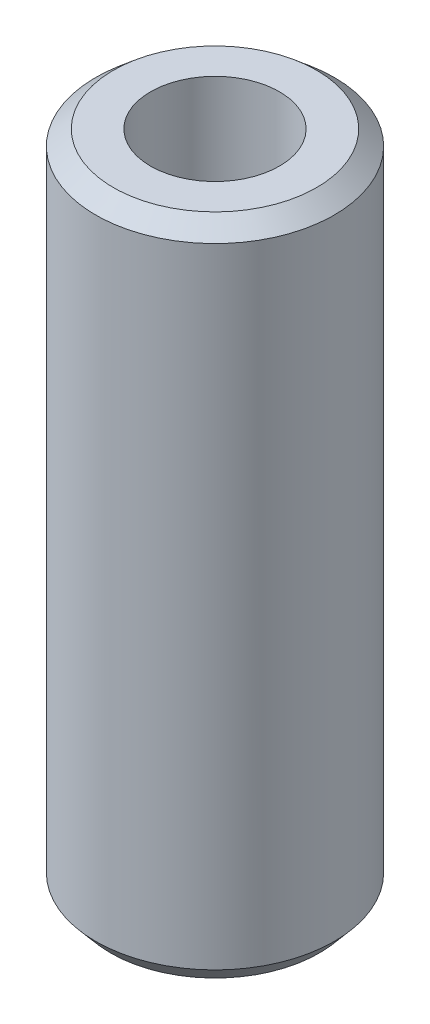
ISO-10303-21;
HEADER;
FILE_DESCRIPTION(('STEP AP214'),'2;1');
FILE_NAME('part.step','',(''),(''),'','','');
FILE_SCHEMA(('AUTOMOTIVE_DESIGN { 1 0 10303 214 1 1 1 1 }'));
ENDSEC;
DATA;
#1=APPLICATION_CONTEXT('core data for automotive mechanical design processes');
#2=APPLICATION_PROTOCOL_DEFINITION('international standard','automotive_design',2000,#1);
#3=PRODUCT_CONTEXT('',#1,'mechanical');
#4=PRODUCT('Part','Part','',(#3));
#5=PRODUCT_RELATED_PRODUCT_CATEGORY('part','',(#4));
#6=PRODUCT_DEFINITION_FORMATION('','',#4);
#7=PRODUCT_DEFINITION_CONTEXT('part definition',#1,'design');
#8=PRODUCT_DEFINITION('design','',#6,#7);
#9=PRODUCT_DEFINITION_SHAPE('','',#8);
#10=(LENGTH_UNIT() NAMED_UNIT(*) SI_UNIT(.MILLI.,.METRE.));
#11=(NAMED_UNIT(*) PLANE_ANGLE_UNIT() SI_UNIT($,.RADIAN.));
#12=(NAMED_UNIT(*) SI_UNIT($,.STERADIAN.) SOLID_ANGLE_UNIT());
#13=UNCERTAINTY_MEASURE_WITH_UNIT(LENGTH_MEASURE(1.E-05),#10,'distance_accuracy_value','');
#14=(GEOMETRIC_REPRESENTATION_CONTEXT(3) GLOBAL_UNCERTAINTY_ASSIGNED_CONTEXT((#13)) GLOBAL_UNIT_ASSIGNED_CONTEXT((#10,
#11,#12)) REPRESENTATION_CONTEXT('',''));
#15=CARTESIAN_POINT('',(0.,0.,0.));
#16=DIRECTION('',(0.,0.,1.));
#17=DIRECTION('',(1.,0.,0.));
#18=AXIS2_PLACEMENT_3D('',#15,#16,#17);
#19=CARTESIAN_POINT('',(0.,55.476175579873,0.));
#20=DIRECTION('',(0.,-1.,0.));
#21=DIRECTION('',(0.,0.,-1.));
#22=AXIS2_PLACEMENT_3D('',#19,#20,#21);
#23=CYLINDRICAL_SURFACE('',#22,10.);
#24=CARTESIAN_POINT('',(0.,54.2202494554918,0.));
#25=DIRECTION('',(0.,1.,0.));
#26=DIRECTION('',(0.,0.,1.));
#27=AXIS2_PLACEMENT_3D('',#24,#25,#26);
#28=CIRCLE('',#27,10.);
#29=CARTESIAN_POINT('',(0.,54.2202494554918,-10.));
#30=VERTEX_POINT('',#29);
#31=EDGE_CURVE('E50',#30,#30,#28,.F.);
#32=ORIENTED_EDGE('',*,*,#31,.T.);
#33=EDGE_LOOP('',(#32));
#34=FACE_BOUND('',#33,.T.);
#35=CARTESIAN_POINT('',(0.,1.47709382366737,0.));
#36=DIRECTION('',(0.,1.,0.));
#37=DIRECTION('',(0.,0.,1.));
#38=AXIS2_PLACEMENT_3D('',#35,#36,#37);
#39=CIRCLE('',#38,10.);
#40=CARTESIAN_POINT('',(0.,1.47709382366737,10.));
#41=VERTEX_POINT('',#40);
#42=EDGE_CURVE('E51',#41,#41,#39,.T.);
#43=ORIENTED_EDGE('',*,*,#42,.T.);
#44=EDGE_LOOP('',(#43));
#45=FACE_BOUND('',#44,.T.);
#46=ADVANCED_FACE('F39',(#34,#45),#23,.T.);
#47=CARTESIAN_POINT('',(0.,55.476175579873,0.));
#48=DIRECTION('',(0.,1.,0.));
#49=DIRECTION('',(0.,0.,1.));
#50=AXIS2_PLACEMENT_3D('',#47,#48,#49);
#51=PLANE('',#50);
#52=CARTESIAN_POINT('',(0.,55.476175579873,0.));
#53=DIRECTION('',(0.,1.,0.));
#54=DIRECTION('',(0.,0.,1.));
#55=AXIS2_PLACEMENT_3D('',#52,#53,#54);
#56=CIRCLE('',#55,8.52290617633265);
#57=CARTESIAN_POINT('',(0.,55.476175579873,-8.52290617633265));
#58=VERTEX_POINT('',#57);
#59=EDGE_CURVE('E54',#58,#58,#56,.T.);
#60=ORIENTED_EDGE('',*,*,#59,.T.);
#61=EDGE_LOOP('',(#60));
#62=FACE_BOUND('',#61,.T.);
#63=CARTESIAN_POINT('',(0.,55.476175579873,0.));
#64=DIRECTION('',(0.,1.,0.));
#65=DIRECTION('',(0.,0.,1.));
#66=AXIS2_PLACEMENT_3D('',#63,#64,#65);
#67=CIRCLE('',#66,5.40477449745994);
#68=CARTESIAN_POINT('',(0.,55.476175579873,5.40477449745994));
#69=VERTEX_POINT('',#68);
#70=EDGE_CURVE('E58',#69,#69,#67,.T.);
#71=ORIENTED_EDGE('',*,*,#70,.F.);
#72=EDGE_LOOP('',(#71));
#73=FACE_BOUND('',#72,.T.);
#74=ADVANCED_FACE('F69',(#62,#73),#51,.T.);
#75=CARTESIAN_POINT('',(0.,0.,0.));
#76=DIRECTION('',(0.,1.,0.));
#77=DIRECTION('',(0.,0.,1.));
#78=AXIS2_PLACEMENT_3D('',#75,#76,#77);
#79=PLANE('',#78);
#80=CARTESIAN_POINT('',(0.,0.,0.));
#81=DIRECTION('',(0.,1.,0.));
#82=DIRECTION('',(0.,0.,1.));
#83=AXIS2_PLACEMENT_3D('',#80,#81,#82);
#84=CIRCLE('',#83,8.7440738756188);
#85=CARTESIAN_POINT('',(0.,0.,8.7440738756188));
#86=VERTEX_POINT('',#85);
#87=EDGE_CURVE('E10',#86,#86,#84,.F.);
#88=ORIENTED_EDGE('',*,*,#87,.T.);
#89=EDGE_LOOP('',(#88));
#90=FACE_BOUND('',#89,.T.);
#91=CARTESIAN_POINT('',(0.,0.,0.));
#92=DIRECTION('',(0.,1.,0.));
#93=DIRECTION('',(0.,0.,1.));
#94=AXIS2_PLACEMENT_3D('',#91,#92,#93);
#95=CIRCLE('',#94,5.40477449745994);
#96=CARTESIAN_POINT('',(0.,0.,5.40477449745994));
#97=VERTEX_POINT('',#96);
#98=EDGE_CURVE('E63',#97,#97,#95,.T.);
#99=ORIENTED_EDGE('',*,*,#98,.T.);
#100=EDGE_LOOP('',(#99));
#101=FACE_BOUND('',#100,.T.);
#102=ADVANCED_FACE('F75',(#90,#101),#79,.F.);
#103=CARTESIAN_POINT('',(0.,55.476175579873,0.));
#104=DIRECTION('',(0.,-1.,0.));
#105=DIRECTION('',(0.,0.,-1.));
#106=AXIS2_PLACEMENT_3D('',#103,#104,#105);
#107=CYLINDRICAL_SURFACE('',#106,5.40477449745994);
#108=ORIENTED_EDGE('',*,*,#70,.T.);
#109=EDGE_LOOP('',(#108));
#110=FACE_BOUND('',#109,.T.);
#111=ORIENTED_EDGE('',*,*,#98,.F.);
#112=EDGE_LOOP('',(#111));
#113=FACE_BOUND('',#112,.T.);
#114=ADVANCED_FACE('F70',(#110,#113),#107,.F.);
#115=CARTESIAN_POINT('',(0.,55.476175579873,0.));
#116=DIRECTION('',(0.,-1.,0.));
#117=DIRECTION('',(0.,0.,-1.));
#118=AXIS2_PLACEMENT_3D('',#115,#116,#117);
#119=CONICAL_SURFACE('',#118,8.52290617633265,0.866146493698119);
#120=CARTESIAN_POINT('',(0.,54.2202494554918,-10.));
#121=CARTESIAN_POINT('',(0.,54.2333320192875,-9.98461360600347));
#122=CARTESIAN_POINT('',(0.,54.2464145830831,-9.96922721200693));
#123=CARTESIAN_POINT('',(0.,54.2725797106744,-9.93845442401386));
#124=CARTESIAN_POINT('',(0.,54.28566227447,-9.92306803001733));
#125=CARTESIAN_POINT('',(0.,54.3118274020613,-9.89229524202426));
#126=CARTESIAN_POINT('',(0.,54.3249099658569,-9.87690884802772));
#127=CARTESIAN_POINT('',(0.,54.3510750934482,-9.84613606003465));
#128=CARTESIAN_POINT('',(0.,54.3641576572438,-9.83074966603812));
#129=CARTESIAN_POINT('',(0.,54.3903227848351,-9.79997687804505));
#130=CARTESIAN_POINT('',(0.,54.4034053486307,-9.78459048404851));
#131=CARTESIAN_POINT('',(0.,54.429570476222,-9.75381769605545));
#132=CARTESIAN_POINT('',(0.,54.4426530400177,-9.73843130205891));
#133=CARTESIAN_POINT('',(0.,54.4688181676089,-9.70765851406584));
#134=CARTESIAN_POINT('',(0.,54.4819007314046,-9.6922721200693));
#135=CARTESIAN_POINT('',(0.,54.5080658589958,-9.66149933207624));
#136=CARTESIAN_POINT('',(0.,54.5211484227915,-9.6461129380797));
#137=CARTESIAN_POINT('',(0.,54.5473135503828,-9.61534015008663));
#138=CARTESIAN_POINT('',(0.,54.5603961141784,-9.5999537560901));
#139=CARTESIAN_POINT('',(0.,54.5865612417697,-9.56918096809703));
#140=CARTESIAN_POINT('',(0.,54.5996438055653,-9.55379457410049));
#141=CARTESIAN_POINT('',(0.,54.6258089331566,-9.52302178610742));
#142=CARTESIAN_POINT('',(0.,54.6388914969522,-9.50763539211089));
#143=CARTESIAN_POINT('',(0.,54.6650566245435,-9.47686260411782));
#144=CARTESIAN_POINT('',(0.,54.6781391883391,-9.46147621012128));
#145=CARTESIAN_POINT('',(0.,54.7043043159304,-9.43070342212821));
#146=CARTESIAN_POINT('',(0.,54.717386879726,-9.41531702813168));
#147=CARTESIAN_POINT('',(0.,54.7435520073173,-9.38454424013861));
#148=CARTESIAN_POINT('',(0.,54.756634571113,-9.36915784614207));
#149=CARTESIAN_POINT('',(0.,54.7827996987042,-9.338385058149));
#150=CARTESIAN_POINT('',(0.,54.7958822624999,-9.32299866415247));
#151=CARTESIAN_POINT('',(0.,54.8220473900911,-9.2922258761594));
#152=CARTESIAN_POINT('',(0.,54.8351299538868,-9.27683948216286));
#153=CARTESIAN_POINT('',(0.,54.8612950814781,-9.24606669416979));
#154=CARTESIAN_POINT('',(0.,54.8743776452737,-9.23068030017326));
#155=CARTESIAN_POINT('',(0.,54.900542772865,-9.19990751218019));
#156=CARTESIAN_POINT('',(0.,54.9136253366606,-9.18452111818365));
#157=CARTESIAN_POINT('',(0.,54.9397904642519,-9.15374833019058));
#158=CARTESIAN_POINT('',(0.,54.9528730280475,-9.13836193619405));
#159=CARTESIAN_POINT('',(0.,54.9790381556388,-9.10758914820098));
#160=CARTESIAN_POINT('',(0.,54.9921207194344,-9.09220275420444));
#161=CARTESIAN_POINT('',(0.,55.0182858470257,-9.06142996621137));
#162=CARTESIAN_POINT('',(0.,55.0313684108213,-9.04604357221484));
#163=CARTESIAN_POINT('',(0.,55.0575335384126,-9.01527078422177));
#164=CARTESIAN_POINT('',(0.,55.0706161022082,-8.99988439022523));
#165=CARTESIAN_POINT('',(0.,55.0967812297995,-8.96911160223216));
#166=CARTESIAN_POINT('',(0.,55.1098637935952,-8.95372520823563));
#167=CARTESIAN_POINT('',(0.,55.1360289211864,-8.92295242024256));
#168=CARTESIAN_POINT('',(0.,55.1491114849821,-8.90756602624602));
#169=CARTESIAN_POINT('',(0.,55.1752766125734,-8.87679323825295));
#170=CARTESIAN_POINT('',(0.,55.188359176369,-8.86140684425642));
#171=CARTESIAN_POINT('',(0.,55.2145243039603,-8.83063405626335));
#172=CARTESIAN_POINT('',(0.,55.2276068677559,-8.81524766226681));
#173=CARTESIAN_POINT('',(0.,55.2537719953472,-8.78447487427374));
#174=CARTESIAN_POINT('',(0.,55.2668545591428,-8.76908848027721));
#175=CARTESIAN_POINT('',(0.,55.2930196867341,-8.73831569228414));
#176=CARTESIAN_POINT('',(0.,55.3061022505297,-8.7229292982876));
#177=CARTESIAN_POINT('',(0.,55.332267378121,-8.69215651029453));
#178=CARTESIAN_POINT('',(0.,55.3453499419166,-8.676770116298));
#179=CARTESIAN_POINT('',(0.,55.3715150695079,-8.64599732830493));
#180=CARTESIAN_POINT('',(0.,55.3845976333035,-8.63061093430839));
#181=CARTESIAN_POINT('',(0.,55.4107627608948,-8.59983814631533));
#182=CARTESIAN_POINT('',(0.,55.4238453246905,-8.58445175231879));
#183=CARTESIAN_POINT('',(0.,55.4500104522817,-8.55367896432572));
#184=CARTESIAN_POINT('',(0.,55.4630930160774,-8.53829257032919));
#185=CARTESIAN_POINT('',(0.,55.476175579873,-8.52290617633265));
#186=B_SPLINE_CURVE_WITH_KNOTS('',3,(#120,#121,#122,#123,#124,#125,#126,#127,#128,#129,#130,
#131,#132,#133,#134,#135,#136,#137,#138,#139,#140,#141,#142,#143,#144,#145,#146,#147,#148,#149,
#150,#151,#152,#153,#154,#155,#156,#157,#158,#159,#160,#161,#162,#163,#164,#165,#166,#167,#168,
#169,#170,#171,#172,#173,#174,#175,#176,#177,#178,#179,#180,#181,#182,#183,#184,#185),
.UNSPECIFIED.,.F.,.F.,(4,2,2,2,2,2,2,2,2,2,2,2,2,2,2,2,2,2,2,2,2,2,2,2,2,2,2,2,2,2,2,2,4),(0.,
0.0605892016876867,0.121178403375378,0.181767605063069,0.242356806750762,0.302946008438453,
0.363535210126144,0.424124411813835,0.484713613501527,0.545302815189219,0.60589201687691,
0.666481218564601,0.727070420252293,0.787659621939984,0.848248823627676,0.908838025315368,
0.969427227003059,1.03001642869075,1.09060563037844,1.15119483206613,1.21178403375383,
1.27237323544152,1.33296243712921,1.3935516388169,1.45414084050459,1.51473004219228,
1.57531924387997,1.63590844556767,1.69649764725536,1.75708684894305,1.81767605063074,
1.87826525231843,1.93885445400612),.UNSPECIFIED.);
#187=EDGE_CURVE('BSEAM81',#30,#58,#186,.T.);
#188=ORIENTED_EDGE('',*,*,#31,.F.);
#189=ORIENTED_EDGE('',*,*,#59,.F.);
#190=ORIENTED_EDGE('',*,*,#187,.T.);
#191=ORIENTED_EDGE('',*,*,#187,.F.);
#192=EDGE_LOOP('',(#188,#190,#189,#191));
#193=FACE_BOUND('',#192,.T.);
#194=ADVANCED_FACE('F81',(#193),#119,.T.);
#195=CARTESIAN_POINT('',(0.,1.47709382366737,0.));
#196=DIRECTION('',(0.,1.,0.));
#197=DIRECTION('',(0.,0.,1.));
#198=AXIS2_PLACEMENT_3D('',#195,#196,#197);
#199=CONICAL_SURFACE('',#198,10.,0.70464983309678);
#200=ORIENTED_EDGE('',*,*,#87,.F.);
#201=EDGE_LOOP('',(#200));
#202=FACE_BOUND('',#201,.T.);
#203=ORIENTED_EDGE('',*,*,#42,.F.);
#204=EDGE_LOOP('',(#203));
#205=FACE_BOUND('',#204,.T.);
#206=ADVANCED_FACE('F45',(#202,#205),#199,.T.);
#207=CLOSED_SHELL('',(#46,#74,#102,#114,#194,#206));
#208=MANIFOLD_SOLID_BREP('B2',#207);
#209=ADVANCED_BREP_SHAPE_REPRESENTATION('',(#18,#208),#14);
#210=SHAPE_DEFINITION_REPRESENTATION(#9,#209);
ENDSEC;
END-ISO-10303-21;
